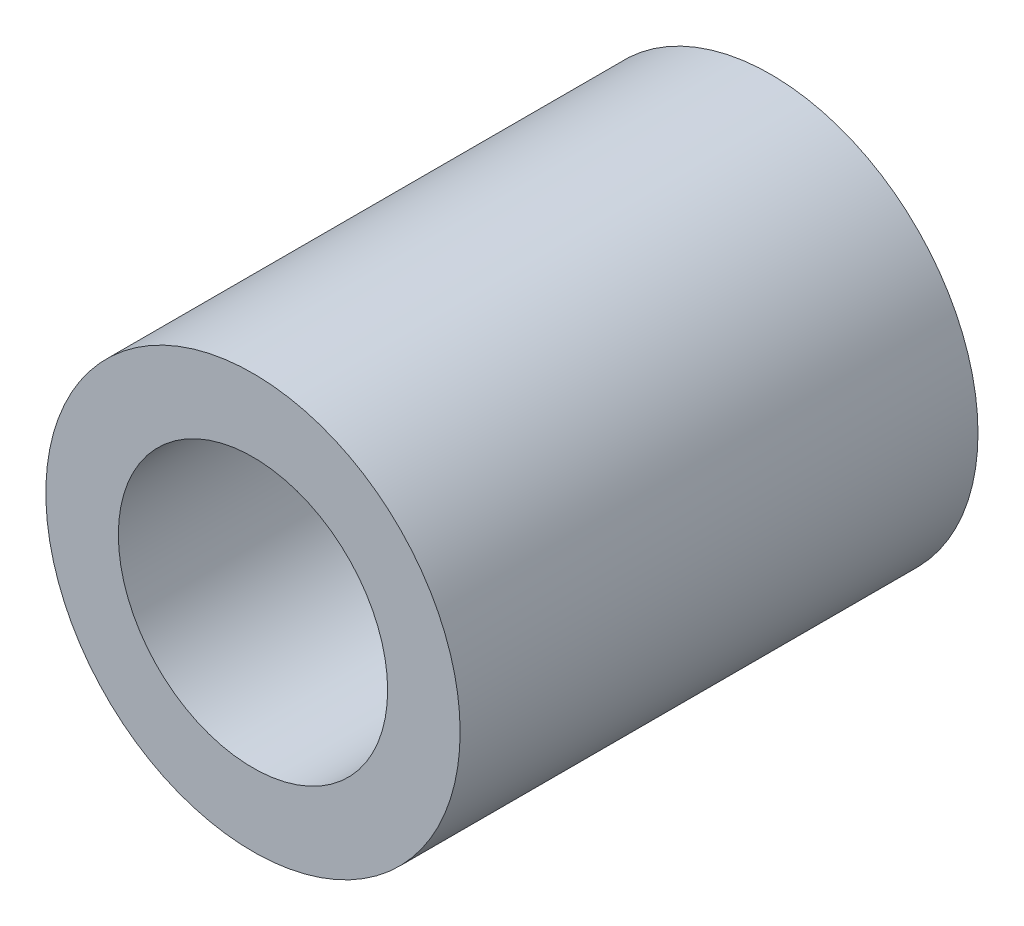
ISO-10303-21;
HEADER;
FILE_DESCRIPTION(('STEP AP214'),'2;1');
FILE_NAME('part.step','',(''),(''),'','','');
FILE_SCHEMA(('AUTOMOTIVE_DESIGN { 1 0 10303 214 1 1 1 1 }'));
ENDSEC;
DATA;
#1=APPLICATION_CONTEXT('core data for automotive mechanical design processes');
#2=APPLICATION_PROTOCOL_DEFINITION('international standard','automotive_design',2000,#1);
#3=PRODUCT_CONTEXT('',#1,'mechanical');
#4=PRODUCT('Part','Part','',(#3));
#5=PRODUCT_RELATED_PRODUCT_CATEGORY('part','',(#4));
#6=PRODUCT_DEFINITION_FORMATION('','',#4);
#7=PRODUCT_DEFINITION_CONTEXT('part definition',#1,'design');
#8=PRODUCT_DEFINITION('design','',#6,#7);
#9=PRODUCT_DEFINITION_SHAPE('','',#8);
#10=(LENGTH_UNIT() NAMED_UNIT(*) SI_UNIT(.MILLI.,.METRE.));
#11=(NAMED_UNIT(*) PLANE_ANGLE_UNIT() SI_UNIT($,.RADIAN.));
#12=(NAMED_UNIT(*) SI_UNIT($,.STERADIAN.) SOLID_ANGLE_UNIT());
#13=UNCERTAINTY_MEASURE_WITH_UNIT(LENGTH_MEASURE(1.E-05),#10,'distance_accuracy_value','');
#14=(GEOMETRIC_REPRESENTATION_CONTEXT(3) GLOBAL_UNCERTAINTY_ASSIGNED_CONTEXT((#13)) GLOBAL_UNIT_ASSIGNED_CONTEXT((#10,
#11,#12)) REPRESENTATION_CONTEXT('',''));
#15=CARTESIAN_POINT('',(0.,0.,0.));
#16=DIRECTION('',(0.,0.,1.));
#17=DIRECTION('',(1.,0.,0.));
#18=AXIS2_PLACEMENT_3D('',#15,#16,#17);
#19=CARTESIAN_POINT('',(0.,0.,-5.));
#20=DIRECTION('',(0.,0.,1.));
#21=DIRECTION('',(1.,0.,0.));
#22=AXIS2_PLACEMENT_3D('',#19,#20,#21);
#23=CYLINDRICAL_SURFACE('',#22,2.);
#24=CARTESIAN_POINT('',(0.,0.,-5.));
#25=DIRECTION('',(0.,0.,1.));
#26=DIRECTION('',(1.,0.,0.));
#27=AXIS2_PLACEMENT_3D('',#24,#25,#26);
#28=CIRCLE('',#27,2.);
#29=CARTESIAN_POINT('',(2.,0.,-5.));
#30=VERTEX_POINT('',#29);
#31=EDGE_CURVE('E12',#30,#30,#28,.T.);
#32=ORIENTED_EDGE('',*,*,#31,.T.);
#33=EDGE_LOOP('',(#32));
#34=FACE_BOUND('',#33,.T.);
#35=CARTESIAN_POINT('',(0.,0.,0.));
#36=DIRECTION('',(0.,0.,1.));
#37=DIRECTION('',(1.,0.,0.));
#38=AXIS2_PLACEMENT_3D('',#35,#36,#37);
#39=CIRCLE('',#38,2.);
#40=CARTESIAN_POINT('',(2.,0.,0.));
#41=VERTEX_POINT('',#40);
#42=EDGE_CURVE('E48',#41,#41,#39,.T.);
#43=ORIENTED_EDGE('',*,*,#42,.F.);
#44=EDGE_LOOP('',(#43));
#45=FACE_BOUND('',#44,.T.);
#46=ADVANCED_FACE('F45',(#34,#45),#23,.T.);
#47=CARTESIAN_POINT('',(0.,0.,-5.));
#48=DIRECTION('',(0.,0.,1.));
#49=DIRECTION('',(1.,0.,0.));
#50=AXIS2_PLACEMENT_3D('',#47,#48,#49);
#51=PLANE('',#50);
#52=CARTESIAN_POINT('',(0.,0.,-5.));
#53=DIRECTION('',(0.,0.,1.));
#54=DIRECTION('',(1.,0.,0.));
#55=AXIS2_PLACEMENT_3D('',#52,#53,#54);
#56=CIRCLE('',#55,1.3);
#57=CARTESIAN_POINT('',(1.3,0.,-5.));
#58=VERTEX_POINT('',#57);
#59=EDGE_CURVE('E55',#58,#58,#56,.T.);
#60=ORIENTED_EDGE('',*,*,#59,.T.);
#61=EDGE_LOOP('',(#60));
#62=FACE_BOUND('',#61,.T.);
#63=ORIENTED_EDGE('',*,*,#31,.F.);
#64=EDGE_LOOP('',(#63));
#65=FACE_BOUND('',#64,.T.);
#66=ADVANCED_FACE('F63',(#62,#65),#51,.F.);
#67=CARTESIAN_POINT('',(0.,0.,0.));
#68=DIRECTION('',(0.,0.,1.));
#69=DIRECTION('',(1.,0.,0.));
#70=AXIS2_PLACEMENT_3D('',#67,#68,#69);
#71=PLANE('',#70);
#72=CARTESIAN_POINT('',(0.,0.,0.));
#73=DIRECTION('',(0.,0.,1.));
#74=DIRECTION('',(1.,0.,0.));
#75=AXIS2_PLACEMENT_3D('',#72,#73,#74);
#76=CIRCLE('',#75,1.3);
#77=CARTESIAN_POINT('',(1.3,0.,0.));
#78=VERTEX_POINT('',#77);
#79=EDGE_CURVE('E57',#78,#78,#76,.T.);
#80=ORIENTED_EDGE('',*,*,#79,.F.);
#81=EDGE_LOOP('',(#80));
#82=FACE_BOUND('',#81,.T.);
#83=ORIENTED_EDGE('',*,*,#42,.T.);
#84=EDGE_LOOP('',(#83));
#85=FACE_BOUND('',#84,.T.);
#86=ADVANCED_FACE('F69',(#82,#85),#71,.T.);
#87=CARTESIAN_POINT('',(0.,0.,-5.));
#88=DIRECTION('',(0.,0.,1.));
#89=DIRECTION('',(1.,0.,0.));
#90=AXIS2_PLACEMENT_3D('',#87,#88,#89);
#91=CYLINDRICAL_SURFACE('',#90,1.3);
#92=ORIENTED_EDGE('',*,*,#59,.F.);
#93=EDGE_LOOP('',(#92));
#94=FACE_BOUND('',#93,.T.);
#95=ORIENTED_EDGE('',*,*,#79,.T.);
#96=EDGE_LOOP('',(#95));
#97=FACE_BOUND('',#96,.T.);
#98=ADVANCED_FACE('F66',(#94,#97),#91,.F.);
#99=CLOSED_SHELL('',(#46,#66,#86,#98));
#100=MANIFOLD_SOLID_BREP('B2',#99);
#101=ADVANCED_BREP_SHAPE_REPRESENTATION('',(#18,#100),#14);
#102=SHAPE_DEFINITION_REPRESENTATION(#9,#101);
ENDSEC;
END-ISO-10303-21;
